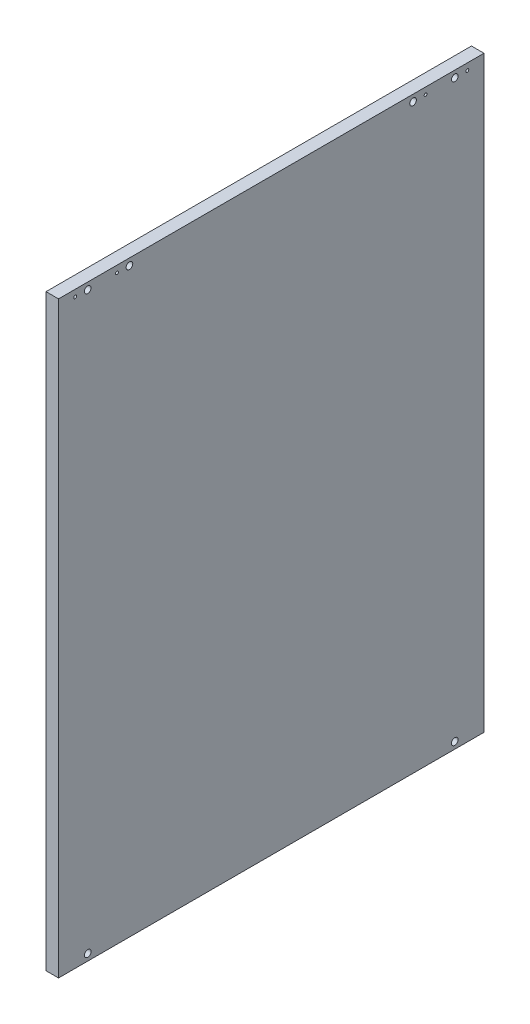
ISO-10303-21;
HEADER;
FILE_DESCRIPTION(('STEP AP214'),'2;1');
FILE_NAME('part.step','',(''),(''),'','','');
FILE_SCHEMA(('AUTOMOTIVE_DESIGN { 1 0 10303 214 1 1 1 1 }'));
ENDSEC;
DATA;
#1=APPLICATION_CONTEXT('core data for automotive mechanical design processes');
#2=APPLICATION_PROTOCOL_DEFINITION('international standard','automotive_design',2000,#1);
#3=PRODUCT_CONTEXT('',#1,'mechanical');
#4=PRODUCT('Part','Part','',(#3));
#5=PRODUCT_RELATED_PRODUCT_CATEGORY('part','',(#4));
#6=PRODUCT_DEFINITION_FORMATION('','',#4);
#7=PRODUCT_DEFINITION_CONTEXT('part definition',#1,'design');
#8=PRODUCT_DEFINITION('design','',#6,#7);
#9=PRODUCT_DEFINITION_SHAPE('','',#8);
#10=(LENGTH_UNIT() NAMED_UNIT(*) SI_UNIT(.MILLI.,.METRE.));
#11=(NAMED_UNIT(*) PLANE_ANGLE_UNIT() SI_UNIT($,.RADIAN.));
#12=(NAMED_UNIT(*) SI_UNIT($,.STERADIAN.) SOLID_ANGLE_UNIT());
#13=UNCERTAINTY_MEASURE_WITH_UNIT(LENGTH_MEASURE(1.E-05),#10,'distance_accuracy_value','');
#14=(GEOMETRIC_REPRESENTATION_CONTEXT(3) GLOBAL_UNCERTAINTY_ASSIGNED_CONTEXT((#13)) GLOBAL_UNIT_ASSIGNED_CONTEXT((#10,
#11,#12)) REPRESENTATION_CONTEXT('',''));
#15=CARTESIAN_POINT('',(0.,0.,0.));
#16=DIRECTION('',(0.,0.,1.));
#17=DIRECTION('',(1.,0.,0.));
#18=AXIS2_PLACEMENT_3D('',#15,#16,#17);
#19=CARTESIAN_POINT('',(15.,0.,0.));
#20=DIRECTION('',(0.,0.,-1.));
#21=DIRECTION('',(-1.,0.,0.));
#22=AXIS2_PLACEMENT_3D('',#19,#20,#21);
#23=PLANE('',#22);
#24=DIRECTION('',(0.,-1.,0.));
#25=VECTOR('',#24,1.);
#26=CARTESIAN_POINT('',(0.,0.,0.));
#27=LINE('',#26,#25);
#28=CARTESIAN_POINT('',(0.,705.,0.));
#29=VERTEX_POINT('',#28);
#30=CARTESIAN_POINT('',(0.,0.,0.));
#31=VERTEX_POINT('',#30);
#32=EDGE_CURVE('E94',#29,#31,#27,.T.);
#33=ORIENTED_EDGE('',*,*,#32,.T.);
#34=DIRECTION('',(-1.,0.,0.));
#35=VECTOR('',#34,1.);
#36=CARTESIAN_POINT('',(15.,0.,0.));
#37=LINE('',#36,#35);
#38=CARTESIAN_POINT('',(15.,0.,0.));
#39=VERTEX_POINT('',#38);
#40=EDGE_CURVE('E11',#39,#31,#37,.T.);
#41=ORIENTED_EDGE('',*,*,#40,.F.);
#42=DIRECTION('',(0.,-1.,0.));
#43=VECTOR('',#42,1.);
#44=CARTESIAN_POINT('',(15.,0.,0.));
#45=LINE('',#44,#43);
#46=CARTESIAN_POINT('',(15.,705.,0.));
#47=VERTEX_POINT('',#46);
#48=EDGE_CURVE('E82',#47,#39,#45,.T.);
#49=ORIENTED_EDGE('',*,*,#48,.F.);
#50=DIRECTION('',(-1.,0.,0.));
#51=VECTOR('',#50,1.);
#52=CARTESIAN_POINT('',(15.,705.,0.));
#53=LINE('',#52,#51);
#54=EDGE_CURVE('E90',#47,#29,#53,.T.);
#55=ORIENTED_EDGE('',*,*,#54,.T.);
#56=EDGE_LOOP('',(#33,#41,#49,#55));
#57=FACE_BOUND('',#56,.T.);
#58=ADVANCED_FACE('F31',(#57),#23,.F.);
#59=CARTESIAN_POINT('',(15.,0.,0.));
#60=DIRECTION('',(0.,1.,0.));
#61=DIRECTION('',(0.,0.,1.));
#62=AXIS2_PLACEMENT_3D('',#59,#60,#61);
#63=PLANE('',#62);
#64=DIRECTION('',(0.,0.,-1.));
#65=VECTOR('',#64,1.);
#66=CARTESIAN_POINT('',(0.,0.,0.));
#67=LINE('',#66,#65);
#68=CARTESIAN_POINT('',(0.,0.,-510.));
#69=VERTEX_POINT('',#68);
#70=EDGE_CURVE('E86',#31,#69,#67,.T.);
#71=ORIENTED_EDGE('',*,*,#70,.T.);
#72=DIRECTION('',(-1.,0.,0.));
#73=VECTOR('',#72,1.);
#74=CARTESIAN_POINT('',(15.,0.,-510.));
#75=LINE('',#74,#73);
#76=CARTESIAN_POINT('',(15.,0.,-510.));
#77=VERTEX_POINT('',#76);
#78=EDGE_CURVE('E39',#77,#69,#75,.T.);
#79=ORIENTED_EDGE('',*,*,#78,.F.);
#80=DIRECTION('',(0.,0.,-1.));
#81=VECTOR('',#80,1.);
#82=CARTESIAN_POINT('',(15.,0.,0.));
#83=LINE('',#82,#81);
#84=EDGE_CURVE('E77',#39,#77,#83,.T.);
#85=ORIENTED_EDGE('',*,*,#84,.F.);
#86=ORIENTED_EDGE('',*,*,#40,.T.);
#87=EDGE_LOOP('',(#71,#79,#85,#86));
#88=FACE_BOUND('',#87,.T.);
#89=ADVANCED_FACE('F85',(#88),#63,.F.);
#90=CARTESIAN_POINT('',(15.,0.,-510.));
#91=DIRECTION('',(0.,0.,1.));
#92=DIRECTION('',(1.,0.,0.));
#93=AXIS2_PLACEMENT_3D('',#90,#91,#92);
#94=PLANE('',#93);
#95=DIRECTION('',(0.,1.,0.));
#96=VECTOR('',#95,1.);
#97=CARTESIAN_POINT('',(0.,0.,-510.));
#98=LINE('',#97,#96);
#99=CARTESIAN_POINT('',(0.,705.,-510.));
#100=VERTEX_POINT('',#99);
#101=EDGE_CURVE('E64',#69,#100,#98,.T.);
#102=ORIENTED_EDGE('',*,*,#101,.T.);
#103=DIRECTION('',(-1.,0.,0.));
#104=VECTOR('',#103,1.);
#105=CARTESIAN_POINT('',(15.,705.,-510.));
#106=LINE('',#105,#104);
#107=CARTESIAN_POINT('',(15.,705.,-510.));
#108=VERTEX_POINT('',#107);
#109=EDGE_CURVE('E87',#108,#100,#106,.T.);
#110=ORIENTED_EDGE('',*,*,#109,.F.);
#111=DIRECTION('',(0.,1.,0.));
#112=VECTOR('',#111,1.);
#113=CARTESIAN_POINT('',(15.,0.,-510.));
#114=LINE('',#113,#112);
#115=EDGE_CURVE('E80',#77,#108,#114,.T.);
#116=ORIENTED_EDGE('',*,*,#115,.F.);
#117=ORIENTED_EDGE('',*,*,#78,.T.);
#118=EDGE_LOOP('',(#102,#110,#116,#117));
#119=FACE_BOUND('',#118,.T.);
#120=ADVANCED_FACE('F88',(#119),#94,.F.);
#121=CARTESIAN_POINT('',(15.,705.,0.));
#122=DIRECTION('',(0.,-1.,0.));
#123=DIRECTION('',(0.,0.,-1.));
#124=AXIS2_PLACEMENT_3D('',#121,#122,#123);
#125=PLANE('',#124);
#126=DIRECTION('',(0.,0.,1.));
#127=VECTOR('',#126,1.);
#128=CARTESIAN_POINT('',(0.,705.,0.));
#129=LINE('',#128,#127);
#130=EDGE_CURVE('E70',#100,#29,#129,.T.);
#131=ORIENTED_EDGE('',*,*,#130,.T.);
#132=ORIENTED_EDGE('',*,*,#54,.F.);
#133=DIRECTION('',(0.,0.,1.));
#134=VECTOR('',#133,1.);
#135=CARTESIAN_POINT('',(15.,705.,0.));
#136=LINE('',#135,#134);
#137=EDGE_CURVE('E47',#108,#47,#136,.T.);
#138=ORIENTED_EDGE('',*,*,#137,.F.);
#139=ORIENTED_EDGE('',*,*,#109,.T.);
#140=EDGE_LOOP('',(#131,#132,#138,#139));
#141=FACE_BOUND('',#140,.T.);
#142=ADVANCED_FACE('F102',(#141),#125,.F.);
#143=CARTESIAN_POINT('',(15.,705.,0.));
#144=DIRECTION('',(-1.,0.,0.));
#145=DIRECTION('',(0.,0.,1.));
#146=AXIS2_PLACEMENT_3D('',#143,#144,#145);
#147=PLANE('',#146);
#148=CARTESIAN_POINT('',(15.,697.,-490.));
#149=DIRECTION('',(1.,0.,0.));
#150=DIRECTION('',(0.,0.,1.));
#151=AXIS2_PLACEMENT_3D('',#148,#149,#150);
#152=CIRCLE('',#151,1.74999999999997);
#153=CARTESIAN_POINT('',(15.,697.,-488.25));
#154=VERTEX_POINT('',#153);
#155=EDGE_CURVE('E162',#154,#154,#152,.T.);
#156=ORIENTED_EDGE('',*,*,#155,.F.);
#157=EDGE_LOOP('',(#156));
#158=FACE_BOUND('',#157,.T.);
#159=CARTESIAN_POINT('',(15.,697.,-70.));
#160=DIRECTION('',(1.,0.,0.));
#161=DIRECTION('',(0.,0.,-1.));
#162=AXIS2_PLACEMENT_3D('',#159,#160,#161);
#163=CIRCLE('',#162,1.74999999999998);
#164=CARTESIAN_POINT('',(15.,697.,-71.75));
#165=VERTEX_POINT('',#164);
#166=EDGE_CURVE('E156',#165,#165,#163,.T.);
#167=ORIENTED_EDGE('',*,*,#166,.F.);
#168=EDGE_LOOP('',(#167));
#169=FACE_BOUND('',#168,.T.);
#170=CARTESIAN_POINT('',(15.,697.,-20.));
#171=DIRECTION('',(1.,0.,0.));
#172=DIRECTION('',(0.,0.,-1.));
#173=AXIS2_PLACEMENT_3D('',#170,#171,#172);
#174=CIRCLE('',#173,1.74999999999998);
#175=CARTESIAN_POINT('',(15.,697.,-21.75));
#176=VERTEX_POINT('',#175);
#177=EDGE_CURVE('E150',#176,#176,#174,.T.);
#178=ORIENTED_EDGE('',*,*,#177,.F.);
#179=EDGE_LOOP('',(#178));
#180=FACE_BOUND('',#179,.T.);
#181=CARTESIAN_POINT('',(15.,697.,-440.));
#182=DIRECTION('',(1.,0.,0.));
#183=DIRECTION('',(0.,0.,1.));
#184=AXIS2_PLACEMENT_3D('',#181,#182,#183);
#185=CIRCLE('',#184,1.74999999999997);
#186=CARTESIAN_POINT('',(15.,697.,-438.25));
#187=VERTEX_POINT('',#186);
#188=EDGE_CURVE('E144',#187,#187,#185,.T.);
#189=ORIENTED_EDGE('',*,*,#188,.F.);
#190=EDGE_LOOP('',(#189));
#191=FACE_BOUND('',#190,.T.);
#192=CARTESIAN_POINT('',(15.,7.99999999999998,-475.));
#193=DIRECTION('',(1.,0.,0.));
#194=DIRECTION('',(0.,0.,-1.));
#195=AXIS2_PLACEMENT_3D('',#192,#193,#194);
#196=CIRCLE('',#195,3.99999999999999);
#197=CARTESIAN_POINT('',(15.,7.99999999999998,-479.));
#198=VERTEX_POINT('',#197);
#199=EDGE_CURVE('E138',#198,#198,#196,.T.);
#200=ORIENTED_EDGE('',*,*,#199,.F.);
#201=EDGE_LOOP('',(#200));
#202=FACE_BOUND('',#201,.T.);
#203=CARTESIAN_POINT('',(15.,8.,-35.));
#204=DIRECTION('',(1.,0.,0.));
#205=DIRECTION('',(0.,0.,-1.));
#206=AXIS2_PLACEMENT_3D('',#203,#204,#205);
#207=CIRCLE('',#206,4.00000000000001);
#208=CARTESIAN_POINT('',(15.,8.,-39.));
#209=VERTEX_POINT('',#208);
#210=EDGE_CURVE('E132',#209,#209,#207,.T.);
#211=ORIENTED_EDGE('',*,*,#210,.F.);
#212=EDGE_LOOP('',(#211));
#213=FACE_BOUND('',#212,.T.);
#214=CARTESIAN_POINT('',(15.,697.,-475.));
#215=DIRECTION('',(1.,0.,0.));
#216=DIRECTION('',(0.,0.,1.));
#217=AXIS2_PLACEMENT_3D('',#214,#215,#216);
#218=CIRCLE('',#217,3.99999999999999);
#219=CARTESIAN_POINT('',(15.,697.,-471.));
#220=VERTEX_POINT('',#219);
#221=EDGE_CURVE('E126',#220,#220,#218,.T.);
#222=ORIENTED_EDGE('',*,*,#221,.F.);
#223=EDGE_LOOP('',(#222));
#224=FACE_BOUND('',#223,.T.);
#225=CARTESIAN_POINT('',(15.,697.,-85.));
#226=DIRECTION('',(1.,0.,0.));
#227=DIRECTION('',(0.,0.,-1.));
#228=AXIS2_PLACEMENT_3D('',#225,#226,#227);
#229=CIRCLE('',#228,4.00000000000001);
#230=CARTESIAN_POINT('',(15.,697.,-89.));
#231=VERTEX_POINT('',#230);
#232=EDGE_CURVE('E120',#231,#231,#229,.T.);
#233=ORIENTED_EDGE('',*,*,#232,.F.);
#234=EDGE_LOOP('',(#233));
#235=FACE_BOUND('',#234,.T.);
#236=CARTESIAN_POINT('',(15.,697.,-35.));
#237=DIRECTION('',(1.,0.,0.));
#238=DIRECTION('',(0.,0.,-1.));
#239=AXIS2_PLACEMENT_3D('',#236,#237,#238);
#240=CIRCLE('',#239,4.00000000000001);
#241=CARTESIAN_POINT('',(15.,697.,-39.));
#242=VERTEX_POINT('',#241);
#243=EDGE_CURVE('E114',#242,#242,#240,.T.);
#244=ORIENTED_EDGE('',*,*,#243,.F.);
#245=EDGE_LOOP('',(#244));
#246=FACE_BOUND('',#245,.T.);
#247=CARTESIAN_POINT('',(15.,697.,-425.));
#248=DIRECTION('',(1.,0.,0.));
#249=DIRECTION('',(0.,0.,1.));
#250=AXIS2_PLACEMENT_3D('',#247,#248,#249);
#251=CIRCLE('',#250,3.99999999999999);
#252=CARTESIAN_POINT('',(15.,697.,-421.));
#253=VERTEX_POINT('',#252);
#254=EDGE_CURVE('E108',#253,#253,#251,.T.);
#255=ORIENTED_EDGE('',*,*,#254,.F.);
#256=EDGE_LOOP('',(#255));
#257=FACE_BOUND('',#256,.T.);
#258=ORIENTED_EDGE('',*,*,#48,.T.);
#259=ORIENTED_EDGE('',*,*,#84,.T.);
#260=ORIENTED_EDGE('',*,*,#115,.T.);
#261=ORIENTED_EDGE('',*,*,#137,.T.);
#262=EDGE_LOOP('',(#258,#259,#260,#261));
#263=FACE_BOUND('',#262,.T.);
#264=ADVANCED_FACE('F78',(#158,#169,#180,#191,#202,#213,#224,#235,#246,#257,#263),#147,.F.);
#265=CARTESIAN_POINT('',(0.,705.,0.));
#266=DIRECTION('',(-1.,0.,0.));
#267=DIRECTION('',(0.,0.,1.));
#268=AXIS2_PLACEMENT_3D('',#265,#266,#267);
#269=PLANE('',#268);
#270=CARTESIAN_POINT('',(0.,697.,-490.));
#271=DIRECTION('',(1.,0.,0.));
#272=DIRECTION('',(0.,0.,1.));
#273=AXIS2_PLACEMENT_3D('',#270,#271,#272);
#274=CIRCLE('',#273,1.74999999999997);
#275=CARTESIAN_POINT('',(0.,697.,-488.25));
#276=VERTEX_POINT('',#275);
#277=EDGE_CURVE('E159',#276,#276,#274,.T.);
#278=ORIENTED_EDGE('',*,*,#277,.T.);
#279=EDGE_LOOP('',(#278));
#280=FACE_BOUND('',#279,.T.);
#281=CARTESIAN_POINT('',(0.,697.,-70.));
#282=DIRECTION('',(1.,0.,0.));
#283=DIRECTION('',(0.,0.,-1.));
#284=AXIS2_PLACEMENT_3D('',#281,#282,#283);
#285=CIRCLE('',#284,1.74999999999998);
#286=CARTESIAN_POINT('',(0.,697.,-71.75));
#287=VERTEX_POINT('',#286);
#288=EDGE_CURVE('E153',#287,#287,#285,.T.);
#289=ORIENTED_EDGE('',*,*,#288,.T.);
#290=EDGE_LOOP('',(#289));
#291=FACE_BOUND('',#290,.T.);
#292=CARTESIAN_POINT('',(0.,697.,-20.));
#293=DIRECTION('',(1.,0.,0.));
#294=DIRECTION('',(0.,0.,-1.));
#295=AXIS2_PLACEMENT_3D('',#292,#293,#294);
#296=CIRCLE('',#295,1.74999999999998);
#297=CARTESIAN_POINT('',(0.,697.,-21.75));
#298=VERTEX_POINT('',#297);
#299=EDGE_CURVE('E147',#298,#298,#296,.T.);
#300=ORIENTED_EDGE('',*,*,#299,.T.);
#301=EDGE_LOOP('',(#300));
#302=FACE_BOUND('',#301,.T.);
#303=CARTESIAN_POINT('',(0.,697.,-440.));
#304=DIRECTION('',(1.,0.,0.));
#305=DIRECTION('',(0.,0.,1.));
#306=AXIS2_PLACEMENT_3D('',#303,#304,#305);
#307=CIRCLE('',#306,1.74999999999997);
#308=CARTESIAN_POINT('',(0.,697.,-438.25));
#309=VERTEX_POINT('',#308);
#310=EDGE_CURVE('E141',#309,#309,#307,.T.);
#311=ORIENTED_EDGE('',*,*,#310,.T.);
#312=EDGE_LOOP('',(#311));
#313=FACE_BOUND('',#312,.T.);
#314=ORIENTED_EDGE('',*,*,#32,.F.);
#315=ORIENTED_EDGE('',*,*,#130,.F.);
#316=ORIENTED_EDGE('',*,*,#101,.F.);
#317=ORIENTED_EDGE('',*,*,#70,.F.);
#318=EDGE_LOOP('',(#314,#315,#316,#317));
#319=FACE_BOUND('',#318,.T.);
#320=ADVANCED_FACE('F105',(#280,#291,#302,#313,#319),#269,.T.);
#321=CARTESIAN_POINT('',(5.,697.,-425.));
#322=DIRECTION('',(1.,0.,0.));
#323=DIRECTION('',(0.,0.,-1.));
#324=AXIS2_PLACEMENT_3D('',#321,#322,#323);
#325=CYLINDRICAL_SURFACE('',#324,3.99999999999999);
#326=CARTESIAN_POINT('',(5.,697.,-425.));
#327=DIRECTION('',(1.,0.,0.));
#328=DIRECTION('',(0.,0.,1.));
#329=AXIS2_PLACEMENT_3D('',#326,#327,#328);
#330=CIRCLE('',#329,3.99999999999999);
#331=CARTESIAN_POINT('',(5.,697.,-421.));
#332=VERTEX_POINT('',#331);
#333=EDGE_CURVE('E97',#332,#332,#330,.T.);
#334=ORIENTED_EDGE('',*,*,#333,.F.);
#335=EDGE_LOOP('',(#334));
#336=FACE_BOUND('',#335,.T.);
#337=ORIENTED_EDGE('',*,*,#254,.T.);
#338=EDGE_LOOP('',(#337));
#339=FACE_BOUND('',#338,.T.);
#340=ADVANCED_FACE('F198',(#336,#339),#325,.F.);
#341=CARTESIAN_POINT('',(5.,697.,-425.));
#342=DIRECTION('',(-1.,0.,0.));
#343=DIRECTION('',(0.,0.,1.));
#344=AXIS2_PLACEMENT_3D('',#341,#342,#343);
#345=PLANE('',#344);
#346=ORIENTED_EDGE('',*,*,#333,.T.);
#347=EDGE_LOOP('',(#346));
#348=FACE_BOUND('',#347,.T.);
#349=ADVANCED_FACE('F200',(#348),#345,.F.);
#350=CARTESIAN_POINT('',(5.,697.,-35.));
#351=DIRECTION('',(1.,0.,0.));
#352=DIRECTION('',(0.,0.,-1.));
#353=AXIS2_PLACEMENT_3D('',#350,#351,#352);
#354=CYLINDRICAL_SURFACE('',#353,4.00000000000001);
#355=CARTESIAN_POINT('',(5.,697.,-35.));
#356=DIRECTION('',(1.,0.,0.));
#357=DIRECTION('',(0.,0.,-1.));
#358=AXIS2_PLACEMENT_3D('',#355,#356,#357);
#359=CIRCLE('',#358,4.00000000000001);
#360=CARTESIAN_POINT('',(5.,697.,-39.));
#361=VERTEX_POINT('',#360);
#362=EDGE_CURVE('E111',#361,#361,#359,.T.);
#363=ORIENTED_EDGE('',*,*,#362,.F.);
#364=EDGE_LOOP('',(#363));
#365=FACE_BOUND('',#364,.T.);
#366=ORIENTED_EDGE('',*,*,#243,.T.);
#367=EDGE_LOOP('',(#366));
#368=FACE_BOUND('',#367,.T.);
#369=ADVANCED_FACE('F207',(#365,#368),#354,.F.);
#370=CARTESIAN_POINT('',(5.,697.,-35.));
#371=DIRECTION('',(1.,0.,0.));
#372=DIRECTION('',(0.,0.,-1.));
#373=AXIS2_PLACEMENT_3D('',#370,#371,#372);
#374=PLANE('',#373);
#375=ORIENTED_EDGE('',*,*,#362,.T.);
#376=EDGE_LOOP('',(#375));
#377=FACE_BOUND('',#376,.T.);
#378=ADVANCED_FACE('F310',(#377),#374,.T.);
#379=CARTESIAN_POINT('',(5.,697.,-85.));
#380=DIRECTION('',(1.,0.,0.));
#381=DIRECTION('',(0.,0.,-1.));
#382=AXIS2_PLACEMENT_3D('',#379,#380,#381);
#383=CYLINDRICAL_SURFACE('',#382,4.00000000000001);
#384=CARTESIAN_POINT('',(5.,697.,-85.));
#385=DIRECTION('',(1.,0.,0.));
#386=DIRECTION('',(0.,0.,-1.));
#387=AXIS2_PLACEMENT_3D('',#384,#385,#386);
#388=CIRCLE('',#387,4.00000000000001);
#389=CARTESIAN_POINT('',(5.,697.,-89.));
#390=VERTEX_POINT('',#389);
#391=EDGE_CURVE('E117',#390,#390,#388,.T.);
#392=ORIENTED_EDGE('',*,*,#391,.F.);
#393=EDGE_LOOP('',(#392));
#394=FACE_BOUND('',#393,.T.);
#395=ORIENTED_EDGE('',*,*,#232,.T.);
#396=EDGE_LOOP('',(#395));
#397=FACE_BOUND('',#396,.T.);
#398=ADVANCED_FACE('F306',(#394,#397),#383,.F.);
#399=CARTESIAN_POINT('',(5.,697.,-85.));
#400=DIRECTION('',(1.,0.,0.));
#401=DIRECTION('',(0.,0.,-1.));
#402=AXIS2_PLACEMENT_3D('',#399,#400,#401);
#403=PLANE('',#402);
#404=ORIENTED_EDGE('',*,*,#391,.T.);
#405=EDGE_LOOP('',(#404));
#406=FACE_BOUND('',#405,.T.);
#407=ADVANCED_FACE('F302',(#406),#403,.T.);
#408=CARTESIAN_POINT('',(5.,697.,-475.));
#409=DIRECTION('',(1.,0.,0.));
#410=DIRECTION('',(0.,0.,-1.));
#411=AXIS2_PLACEMENT_3D('',#408,#409,#410);
#412=CYLINDRICAL_SURFACE('',#411,3.99999999999999);
#413=CARTESIAN_POINT('',(5.,697.,-475.));
#414=DIRECTION('',(1.,0.,0.));
#415=DIRECTION('',(0.,0.,1.));
#416=AXIS2_PLACEMENT_3D('',#413,#414,#415);
#417=CIRCLE('',#416,3.99999999999999);
#418=CARTESIAN_POINT('',(5.,697.,-471.));
#419=VERTEX_POINT('',#418);
#420=EDGE_CURVE('E123',#419,#419,#417,.T.);
#421=ORIENTED_EDGE('',*,*,#420,.F.);
#422=EDGE_LOOP('',(#421));
#423=FACE_BOUND('',#422,.T.);
#424=ORIENTED_EDGE('',*,*,#221,.T.);
#425=EDGE_LOOP('',(#424));
#426=FACE_BOUND('',#425,.T.);
#427=ADVANCED_FACE('F298',(#423,#426),#412,.F.);
#428=CARTESIAN_POINT('',(5.,697.,-475.));
#429=DIRECTION('',(-1.,0.,0.));
#430=DIRECTION('',(0.,0.,1.));
#431=AXIS2_PLACEMENT_3D('',#428,#429,#430);
#432=PLANE('',#431);
#433=ORIENTED_EDGE('',*,*,#420,.T.);
#434=EDGE_LOOP('',(#433));
#435=FACE_BOUND('',#434,.T.);
#436=ADVANCED_FACE('F294',(#435),#432,.F.);
#437=CARTESIAN_POINT('',(5.,8.,-35.));
#438=DIRECTION('',(1.,0.,0.));
#439=DIRECTION('',(0.,0.,-1.));
#440=AXIS2_PLACEMENT_3D('',#437,#438,#439);
#441=CYLINDRICAL_SURFACE('',#440,4.00000000000001);
#442=CARTESIAN_POINT('',(5.,8.,-35.));
#443=DIRECTION('',(1.,0.,0.));
#444=DIRECTION('',(0.,0.,-1.));
#445=AXIS2_PLACEMENT_3D('',#442,#443,#444);
#446=CIRCLE('',#445,4.00000000000001);
#447=CARTESIAN_POINT('',(5.,8.,-39.));
#448=VERTEX_POINT('',#447);
#449=EDGE_CURVE('E129',#448,#448,#446,.T.);
#450=ORIENTED_EDGE('',*,*,#449,.F.);
#451=EDGE_LOOP('',(#450));
#452=FACE_BOUND('',#451,.T.);
#453=ORIENTED_EDGE('',*,*,#210,.T.);
#454=EDGE_LOOP('',(#453));
#455=FACE_BOUND('',#454,.T.);
#456=ADVANCED_FACE('F290',(#452,#455),#441,.F.);
#457=CARTESIAN_POINT('',(5.,8.,-35.));
#458=DIRECTION('',(1.,0.,0.));
#459=DIRECTION('',(0.,0.,-1.));
#460=AXIS2_PLACEMENT_3D('',#457,#458,#459);
#461=PLANE('',#460);
#462=ORIENTED_EDGE('',*,*,#449,.T.);
#463=EDGE_LOOP('',(#462));
#464=FACE_BOUND('',#463,.T.);
#465=ADVANCED_FACE('F286',(#464),#461,.T.);
#466=CARTESIAN_POINT('',(5.,7.99999999999998,-475.));
#467=DIRECTION('',(1.,0.,0.));
#468=DIRECTION('',(0.,0.,-1.));
#469=AXIS2_PLACEMENT_3D('',#466,#467,#468);
#470=CYLINDRICAL_SURFACE('',#469,3.99999999999999);
#471=CARTESIAN_POINT('',(5.,7.99999999999998,-475.));
#472=DIRECTION('',(1.,0.,0.));
#473=DIRECTION('',(0.,0.,-1.));
#474=AXIS2_PLACEMENT_3D('',#471,#472,#473);
#475=CIRCLE('',#474,3.99999999999999);
#476=CARTESIAN_POINT('',(5.,7.99999999999998,-479.));
#477=VERTEX_POINT('',#476);
#478=EDGE_CURVE('E135',#477,#477,#475,.T.);
#479=ORIENTED_EDGE('',*,*,#478,.F.);
#480=EDGE_LOOP('',(#479));
#481=FACE_BOUND('',#480,.T.);
#482=ORIENTED_EDGE('',*,*,#199,.T.);
#483=EDGE_LOOP('',(#482));
#484=FACE_BOUND('',#483,.T.);
#485=ADVANCED_FACE('F282',(#481,#484),#470,.F.);
#486=CARTESIAN_POINT('',(5.,7.99999999999998,-475.));
#487=DIRECTION('',(1.,0.,0.));
#488=DIRECTION('',(0.,0.,-1.));
#489=AXIS2_PLACEMENT_3D('',#486,#487,#488);
#490=PLANE('',#489);
#491=ORIENTED_EDGE('',*,*,#478,.T.);
#492=EDGE_LOOP('',(#491));
#493=FACE_BOUND('',#492,.T.);
#494=ADVANCED_FACE('F247',(#493),#490,.T.);
#495=CARTESIAN_POINT('',(0.,697.,-440.));
#496=DIRECTION('',(1.,0.,0.));
#497=DIRECTION('',(0.,0.,-1.));
#498=AXIS2_PLACEMENT_3D('',#495,#496,#497);
#499=CYLINDRICAL_SURFACE('',#498,1.74999999999997);
#500=ORIENTED_EDGE('',*,*,#310,.F.);
#501=EDGE_LOOP('',(#500));
#502=FACE_BOUND('',#501,.T.);
#503=ORIENTED_EDGE('',*,*,#188,.T.);
#504=EDGE_LOOP('',(#503));
#505=FACE_BOUND('',#504,.T.);
#506=ADVANCED_FACE('F241',(#502,#505),#499,.F.);
#507=CARTESIAN_POINT('',(0.,697.,-20.));
#508=DIRECTION('',(1.,0.,0.));
#509=DIRECTION('',(0.,0.,-1.));
#510=AXIS2_PLACEMENT_3D('',#507,#508,#509);
#511=CYLINDRICAL_SURFACE('',#510,1.74999999999998);
#512=ORIENTED_EDGE('',*,*,#299,.F.);
#513=EDGE_LOOP('',(#512));
#514=FACE_BOUND('',#513,.T.);
#515=ORIENTED_EDGE('',*,*,#177,.T.);
#516=EDGE_LOOP('',(#515));
#517=FACE_BOUND('',#516,.T.);
#518=ADVANCED_FACE('F246',(#514,#517),#511,.F.);
#519=CARTESIAN_POINT('',(0.,697.,-70.));
#520=DIRECTION('',(1.,0.,0.));
#521=DIRECTION('',(0.,0.,-1.));
#522=AXIS2_PLACEMENT_3D('',#519,#520,#521);
#523=CYLINDRICAL_SURFACE('',#522,1.74999999999998);
#524=ORIENTED_EDGE('',*,*,#288,.F.);
#525=EDGE_LOOP('',(#524));
#526=FACE_BOUND('',#525,.T.);
#527=ORIENTED_EDGE('',*,*,#166,.T.);
#528=EDGE_LOOP('',(#527));
#529=FACE_BOUND('',#528,.T.);
#530=ADVANCED_FACE('F173',(#526,#529),#523,.F.);
#531=CARTESIAN_POINT('',(0.,697.,-490.));
#532=DIRECTION('',(1.,0.,0.));
#533=DIRECTION('',(0.,0.,-1.));
#534=AXIS2_PLACEMENT_3D('',#531,#532,#533);
#535=CYLINDRICAL_SURFACE('',#534,1.74999999999997);
#536=ORIENTED_EDGE('',*,*,#277,.F.);
#537=EDGE_LOOP('',(#536));
#538=FACE_BOUND('',#537,.T.);
#539=ORIENTED_EDGE('',*,*,#155,.T.);
#540=EDGE_LOOP('',(#539));
#541=FACE_BOUND('',#540,.T.);
#542=ADVANCED_FACE('F170',(#538,#541),#535,.F.);
#543=CLOSED_SHELL('',(#58,#89,#120,#142,#264,#320,#340,#349,#369,#378,#398,#407,#427,#436,#456,
#465,#485,#494,#506,#518,#530,#542));
#544=MANIFOLD_SOLID_BREP('B2',#543);
#545=ADVANCED_BREP_SHAPE_REPRESENTATION('',(#18,#544),#14);
#546=SHAPE_DEFINITION_REPRESENTATION(#9,#545);
ENDSEC;
END-ISO-10303-21;
